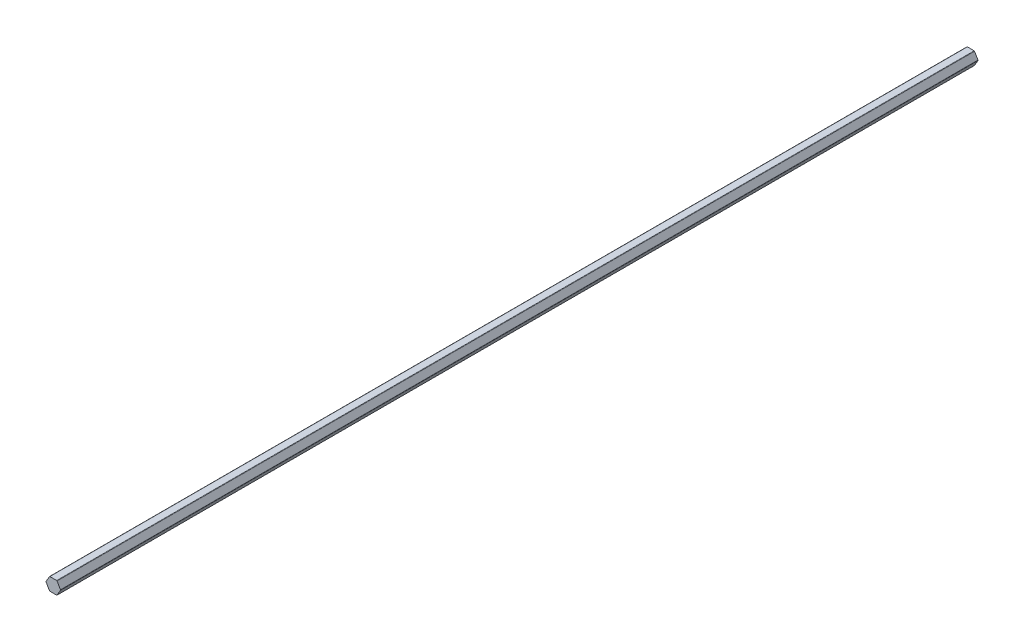
ISO-10303-21;
HEADER;
FILE_DESCRIPTION(('STEP AP214'),'2;1');
FILE_NAME('part.step','',(''),(''),'','','');
FILE_SCHEMA(('AUTOMOTIVE_DESIGN { 1 0 10303 214 1 1 1 1 }'));
ENDSEC;
DATA;
#1=APPLICATION_CONTEXT('core data for automotive mechanical design processes');
#2=APPLICATION_PROTOCOL_DEFINITION('international standard','automotive_design',2000,#1);
#3=PRODUCT_CONTEXT('',#1,'mechanical');
#4=PRODUCT('Part','Part','',(#3));
#5=PRODUCT_RELATED_PRODUCT_CATEGORY('part','',(#4));
#6=PRODUCT_DEFINITION_FORMATION('','',#4);
#7=PRODUCT_DEFINITION_CONTEXT('part definition',#1,'design');
#8=PRODUCT_DEFINITION('design','',#6,#7);
#9=PRODUCT_DEFINITION_SHAPE('','',#8);
#10=(LENGTH_UNIT() NAMED_UNIT(*) SI_UNIT(.MILLI.,.METRE.));
#11=(NAMED_UNIT(*) PLANE_ANGLE_UNIT() SI_UNIT($,.RADIAN.));
#12=(NAMED_UNIT(*) SI_UNIT($,.STERADIAN.) SOLID_ANGLE_UNIT());
#13=UNCERTAINTY_MEASURE_WITH_UNIT(LENGTH_MEASURE(1.E-05),#10,'distance_accuracy_value','');
#14=(GEOMETRIC_REPRESENTATION_CONTEXT(3) GLOBAL_UNCERTAINTY_ASSIGNED_CONTEXT((#13)) GLOBAL_UNIT_ASSIGNED_CONTEXT((#10,
#11,#12)) REPRESENTATION_CONTEXT('',''));
#15=CARTESIAN_POINT('',(0.,0.,0.));
#16=DIRECTION('',(0.,0.,1.));
#17=DIRECTION('',(1.,0.,0.));
#18=AXIS2_PLACEMENT_3D('',#15,#16,#17);
#19=CARTESIAN_POINT('',(3.36554792418709,5.8293,457.2));
#20=DIRECTION('',(0.,0.,-1.));
#21=DIRECTION('',(-1.,0.,0.));
#22=AXIS2_PLACEMENT_3D('',#19,#20,#21);
#23=CYLINDRICAL_SURFACE('',#22,0.508);
#24=CARTESIAN_POINT('',(3.36554792418709,5.8293,457.2));
#25=DIRECTION('',(0.,0.,1.));
#26=DIRECTION('',(1.,0.,0.));
#27=AXIS2_PLACEMENT_3D('',#24,#25,#26);
#28=CIRCLE('',#27,0.508);
#29=CARTESIAN_POINT('',(3.80548882930957,6.0833,457.2));
#30=VERTEX_POINT('',#29);
#31=CARTESIAN_POINT('',(3.36554792418709,6.3373,457.2));
#32=VERTEX_POINT('',#31);
#33=EDGE_CURVE('E262',#30,#32,#28,.T.);
#34=ORIENTED_EDGE('',*,*,#33,.F.);
#35=DIRECTION('',(0.,0.,1.));
#36=VECTOR('',#35,1.);
#37=CARTESIAN_POINT('',(3.80548882930958,6.0833,457.2));
#38=LINE('',#37,#36);
#39=CARTESIAN_POINT('',(3.80548882930957,6.0833,-457.2));
#40=VERTEX_POINT('',#39);
#41=EDGE_CURVE('E289',#40,#30,#38,.T.);
#42=ORIENTED_EDGE('',*,*,#41,.F.);
#43=CARTESIAN_POINT('',(3.36554792418709,5.8293,-457.2));
#44=DIRECTION('',(0.,0.,-1.));
#45=DIRECTION('',(1.,0.,0.));
#46=AXIS2_PLACEMENT_3D('',#43,#44,#45);
#47=CIRCLE('',#46,0.508);
#48=CARTESIAN_POINT('',(3.36554792418709,6.3373,-457.2));
#49=VERTEX_POINT('',#48);
#50=EDGE_CURVE('E203',#49,#40,#47,.T.);
#51=ORIENTED_EDGE('',*,*,#50,.F.);
#52=DIRECTION('',(0.,0.,-1.));
#53=VECTOR('',#52,1.);
#54=CARTESIAN_POINT('',(3.36554792418709,6.3373,457.2));
#55=LINE('',#54,#53);
#56=EDGE_CURVE('E197',#32,#49,#55,.T.);
#57=ORIENTED_EDGE('',*,*,#56,.F.);
#58=EDGE_LOOP('',(#34,#42,#51,#57));
#59=FACE_BOUND('',#58,.T.);
#60=ADVANCED_FACE('F15',(#59),#23,.T.);
#61=CARTESIAN_POINT('',(-3.36554792418709,5.8293,457.2));
#62=DIRECTION('',(0.,0.,-1.));
#63=DIRECTION('',(-1.,0.,0.));
#64=AXIS2_PLACEMENT_3D('',#61,#62,#63);
#65=CYLINDRICAL_SURFACE('',#64,0.508);
#66=CARTESIAN_POINT('',(-3.36554792418709,5.8293,457.2));
#67=DIRECTION('',(0.,0.,1.));
#68=DIRECTION('',(1.,0.,0.));
#69=AXIS2_PLACEMENT_3D('',#66,#67,#68);
#70=CIRCLE('',#69,0.508);
#71=CARTESIAN_POINT('',(-3.36554792418708,6.3373,457.2));
#72=VERTEX_POINT('',#71);
#73=CARTESIAN_POINT('',(-3.80548882930958,6.0833,457.2));
#74=VERTEX_POINT('',#73);
#75=EDGE_CURVE('E271',#72,#74,#70,.T.);
#76=ORIENTED_EDGE('',*,*,#75,.F.);
#77=DIRECTION('',(0.,0.,1.));
#78=VECTOR('',#77,1.);
#79=CARTESIAN_POINT('',(-3.36554792418709,6.3373,457.2));
#80=LINE('',#79,#78);
#81=CARTESIAN_POINT('',(-3.36554792418708,6.3373,-457.2));
#82=VERTEX_POINT('',#81);
#83=EDGE_CURVE('E226',#82,#72,#80,.T.);
#84=ORIENTED_EDGE('',*,*,#83,.F.);
#85=CARTESIAN_POINT('',(-3.36554792418709,5.8293,-457.2));
#86=DIRECTION('',(0.,0.,-1.));
#87=DIRECTION('',(1.,0.,0.));
#88=AXIS2_PLACEMENT_3D('',#85,#86,#87);
#89=CIRCLE('',#88,0.508);
#90=CARTESIAN_POINT('',(-3.80548882930958,6.0833,-457.2));
#91=VERTEX_POINT('',#90);
#92=EDGE_CURVE('E206',#91,#82,#89,.T.);
#93=ORIENTED_EDGE('',*,*,#92,.F.);
#94=DIRECTION('',(0.,0.,-1.));
#95=VECTOR('',#94,1.);
#96=CARTESIAN_POINT('',(-3.80548882930958,6.0833,457.2));
#97=LINE('',#96,#95);
#98=EDGE_CURVE('E274',#74,#91,#97,.T.);
#99=ORIENTED_EDGE('',*,*,#98,.F.);
#100=EDGE_LOOP('',(#76,#84,#93,#99));
#101=FACE_BOUND('',#100,.T.);
#102=ADVANCED_FACE('F336',(#101),#65,.T.);
#103=CARTESIAN_POINT('',(6.73109584837417,0.,457.2));
#104=DIRECTION('',(0.,0.,-1.));
#105=DIRECTION('',(-1.,0.,0.));
#106=AXIS2_PLACEMENT_3D('',#103,#104,#105);
#107=CYLINDRICAL_SURFACE('',#106,0.508);
#108=CARTESIAN_POINT('',(6.73109584837417,0.,457.2));
#109=DIRECTION('',(0.,0.,1.));
#110=DIRECTION('',(1.,0.,0.));
#111=AXIS2_PLACEMENT_3D('',#108,#109,#110);
#112=CIRCLE('',#111,0.508);
#113=CARTESIAN_POINT('',(7.17103675349666,-0.254,457.2));
#114=VERTEX_POINT('',#113);
#115=CARTESIAN_POINT('',(7.17103675349666,0.254000000000004,457.2));
#116=VERTEX_POINT('',#115);
#117=EDGE_CURVE('E208',#114,#116,#112,.T.);
#118=ORIENTED_EDGE('',*,*,#117,.F.);
#119=DIRECTION('',(0.,0.,1.));
#120=VECTOR('',#119,1.);
#121=CARTESIAN_POINT('',(7.17103675349667,-0.253999999999996,457.2));
#122=LINE('',#121,#120);
#123=CARTESIAN_POINT('',(7.17103675349666,-0.254,-457.2));
#124=VERTEX_POINT('',#123);
#125=EDGE_CURVE('E190',#124,#114,#122,.T.);
#126=ORIENTED_EDGE('',*,*,#125,.F.);
#127=CARTESIAN_POINT('',(6.73109584837417,0.,-457.2));
#128=DIRECTION('',(0.,0.,-1.));
#129=DIRECTION('',(1.,0.,0.));
#130=AXIS2_PLACEMENT_3D('',#127,#128,#129);
#131=CIRCLE('',#130,0.508);
#132=CARTESIAN_POINT('',(7.17103675349666,0.254000000000004,-457.2));
#133=VERTEX_POINT('',#132);
#134=EDGE_CURVE('E26',#133,#124,#131,.T.);
#135=ORIENTED_EDGE('',*,*,#134,.F.);
#136=DIRECTION('',(0.,0.,-1.));
#137=VECTOR('',#136,1.);
#138=CARTESIAN_POINT('',(7.17103675349666,0.254,457.2));
#139=LINE('',#138,#137);
#140=EDGE_CURVE('E257',#116,#133,#139,.T.);
#141=ORIENTED_EDGE('',*,*,#140,.F.);
#142=EDGE_LOOP('',(#118,#126,#135,#141));
#143=FACE_BOUND('',#142,.T.);
#144=ADVANCED_FACE('F243',(#143),#107,.T.);
#145=CARTESIAN_POINT('',(3.36554792418709,-5.8293,457.2));
#146=DIRECTION('',(0.,0.,-1.));
#147=DIRECTION('',(-1.,0.,0.));
#148=AXIS2_PLACEMENT_3D('',#145,#146,#147);
#149=CYLINDRICAL_SURFACE('',#148,0.508);
#150=CARTESIAN_POINT('',(3.36554792418709,-5.8293,457.2));
#151=DIRECTION('',(0.,0.,1.));
#152=DIRECTION('',(1.,0.,0.));
#153=AXIS2_PLACEMENT_3D('',#150,#151,#152);
#154=CIRCLE('',#153,0.508);
#155=CARTESIAN_POINT('',(3.36554792418709,-6.3373,457.2));
#156=VERTEX_POINT('',#155);
#157=CARTESIAN_POINT('',(3.80548882930958,-6.0833,457.2));
#158=VERTEX_POINT('',#157);
#159=EDGE_CURVE('E161',#156,#158,#154,.T.);
#160=ORIENTED_EDGE('',*,*,#159,.F.);
#161=DIRECTION('',(0.,0.,1.));
#162=VECTOR('',#161,1.);
#163=CARTESIAN_POINT('',(3.36554792418709,-6.3373,457.2));
#164=LINE('',#163,#162);
#165=CARTESIAN_POINT('',(3.36554792418709,-6.3373,-457.2));
#166=VERTEX_POINT('',#165);
#167=EDGE_CURVE('E162',#166,#156,#164,.T.);
#168=ORIENTED_EDGE('',*,*,#167,.F.);
#169=CARTESIAN_POINT('',(3.36554792418709,-5.8293,-457.2));
#170=DIRECTION('',(0.,0.,-1.));
#171=DIRECTION('',(1.,0.,0.));
#172=AXIS2_PLACEMENT_3D('',#169,#170,#171);
#173=CIRCLE('',#172,0.508);
#174=CARTESIAN_POINT('',(3.80548882930958,-6.0833,-457.2));
#175=VERTEX_POINT('',#174);
#176=EDGE_CURVE('E9',#175,#166,#173,.T.);
#177=ORIENTED_EDGE('',*,*,#176,.F.);
#178=DIRECTION('',(0.,0.,-1.));
#179=VECTOR('',#178,1.);
#180=CARTESIAN_POINT('',(3.80548882930958,-6.0833,457.2));
#181=LINE('',#180,#179);
#182=EDGE_CURVE('E191',#158,#175,#181,.T.);
#183=ORIENTED_EDGE('',*,*,#182,.F.);
#184=EDGE_LOOP('',(#160,#168,#177,#183));
#185=FACE_BOUND('',#184,.T.);
#186=ADVANCED_FACE('F411',(#185),#149,.T.);
#187=CARTESIAN_POINT('',(-6.73109584837417,0.,457.2));
#188=DIRECTION('',(0.,0.,-1.));
#189=DIRECTION('',(-1.,0.,0.));
#190=AXIS2_PLACEMENT_3D('',#187,#188,#189);
#191=CYLINDRICAL_SURFACE('',#190,0.508);
#192=DIRECTION('',(0.,0.,-1.));
#193=VECTOR('',#192,1.);
#194=CARTESIAN_POINT('',(-7.23909584837417,0.,457.2));
#195=LINE('',#194,#193);
#196=CARTESIAN_POINT('',(-7.23909584837417,0.,457.2));
#197=VERTEX_POINT('',#196);
#198=CARTESIAN_POINT('',(-7.23909584837417,0.,-457.2));
#199=VERTEX_POINT('',#198);
#200=EDGE_CURVE('E217',#197,#199,#195,.T.);
#201=ORIENTED_EDGE('',*,*,#200,.F.);
#202=CARTESIAN_POINT('',(-6.73109584837417,0.,457.2));
#203=DIRECTION('',(0.,0.,1.));
#204=DIRECTION('',(1.,0.,0.));
#205=AXIS2_PLACEMENT_3D('',#202,#203,#204);
#206=CIRCLE('',#205,0.508);
#207=CARTESIAN_POINT('',(-7.17103675349666,0.253999999999997,457.2));
#208=VERTEX_POINT('',#207);
#209=EDGE_CURVE('E268',#208,#197,#206,.T.);
#210=ORIENTED_EDGE('',*,*,#209,.F.);
#211=DIRECTION('',(0.,0.,1.));
#212=VECTOR('',#211,1.);
#213=CARTESIAN_POINT('',(-7.17103675349666,0.253999999999995,457.2));
#214=LINE('',#213,#212);
#215=CARTESIAN_POINT('',(-7.17103675349666,0.253999999999997,-457.2));
#216=VERTEX_POINT('',#215);
#217=EDGE_CURVE('E263',#216,#208,#214,.T.);
#218=ORIENTED_EDGE('',*,*,#217,.F.);
#219=CARTESIAN_POINT('',(-6.73109584837417,0.,-457.2));
#220=DIRECTION('',(0.,0.,-1.));
#221=DIRECTION('',(1.,0.,0.));
#222=AXIS2_PLACEMENT_3D('',#219,#220,#221);
#223=CIRCLE('',#222,0.508);
#224=EDGE_CURVE('E117',#199,#216,#223,.T.);
#225=ORIENTED_EDGE('',*,*,#224,.F.);
#226=EDGE_LOOP('',(#201,#210,#218,#225));
#227=FACE_BOUND('',#226,.T.);
#228=ADVANCED_FACE('F341',(#227),#191,.T.);
#229=CARTESIAN_POINT('',(-3.36554792418708,-5.8293,457.2));
#230=DIRECTION('',(0.,0.,-1.));
#231=DIRECTION('',(-1.,0.,0.));
#232=AXIS2_PLACEMENT_3D('',#229,#230,#231);
#233=CYLINDRICAL_SURFACE('',#232,0.508);
#234=CARTESIAN_POINT('',(-3.36554792418708,-5.8293,457.2));
#235=DIRECTION('',(0.,0.,1.));
#236=DIRECTION('',(1.,0.,0.));
#237=AXIS2_PLACEMENT_3D('',#234,#235,#236);
#238=CIRCLE('',#237,0.508);
#239=CARTESIAN_POINT('',(-3.80548882930957,-6.0833,457.2));
#240=VERTEX_POINT('',#239);
#241=CARTESIAN_POINT('',(-3.36554792418708,-6.3373,457.2));
#242=VERTEX_POINT('',#241);
#243=EDGE_CURVE('E151',#240,#242,#238,.T.);
#244=ORIENTED_EDGE('',*,*,#243,.F.);
#245=DIRECTION('',(0.,0.,1.));
#246=VECTOR('',#245,1.);
#247=CARTESIAN_POINT('',(-3.80548882930957,-6.0833,457.2));
#248=LINE('',#247,#246);
#249=CARTESIAN_POINT('',(-3.80548882930957,-6.0833,-457.2));
#250=VERTEX_POINT('',#249);
#251=EDGE_CURVE('E181',#250,#240,#248,.T.);
#252=ORIENTED_EDGE('',*,*,#251,.F.);
#253=CARTESIAN_POINT('',(-3.36554792418708,-5.8293,-457.2));
#254=DIRECTION('',(0.,0.,-1.));
#255=DIRECTION('',(1.,0.,0.));
#256=AXIS2_PLACEMENT_3D('',#253,#254,#255);
#257=CIRCLE('',#256,0.508);
#258=CARTESIAN_POINT('',(-3.36554792418708,-6.3373,-457.2));
#259=VERTEX_POINT('',#258);
#260=EDGE_CURVE('E167',#259,#250,#257,.T.);
#261=ORIENTED_EDGE('',*,*,#260,.F.);
#262=DIRECTION('',(0.,0.,-1.));
#263=VECTOR('',#262,1.);
#264=CARTESIAN_POINT('',(-3.36554792418708,-6.3373,457.2));
#265=LINE('',#264,#263);
#266=EDGE_CURVE('E165',#242,#259,#265,.T.);
#267=ORIENTED_EDGE('',*,*,#266,.F.);
#268=EDGE_LOOP('',(#244,#252,#261,#267));
#269=FACE_BOUND('',#268,.T.);
#270=ADVANCED_FACE('F166',(#269),#233,.T.);
#271=CARTESIAN_POINT('',(7.31768372187083,0.,-457.2));
#272=DIRECTION('',(0.,0.,1.));
#273=DIRECTION('',(1.,0.,0.));
#274=AXIS2_PLACEMENT_3D('',#271,#272,#273);
#275=PLANE('',#274);
#276=DIRECTION('',(1.,0.,0.));
#277=VECTOR('',#276,1.);
#278=CARTESIAN_POINT('',(-3.6588418609354,-6.3373,-457.2));
#279=LINE('',#278,#277);
#280=EDGE_CURVE('E171',#259,#166,#279,.T.);
#281=ORIENTED_EDGE('',*,*,#280,.F.);
#282=ORIENTED_EDGE('',*,*,#260,.T.);
#283=DIRECTION('',(0.5,-0.866025403784439,0.));
#284=VECTOR('',#283,1.);
#285=CARTESIAN_POINT('',(-7.31768372187083,0.,-457.2));
#286=LINE('',#285,#284);
#287=CARTESIAN_POINT('',(-7.17103675349666,-0.254000000000004,-457.2));
#288=VERTEX_POINT('',#287);
#289=EDGE_CURVE('E125',#288,#250,#286,.T.);
#290=ORIENTED_EDGE('',*,*,#289,.F.);
#291=CARTESIAN_POINT('',(-6.73109584837417,0.,-457.2));
#292=DIRECTION('',(0.,0.,-1.));
#293=DIRECTION('',(1.,0.,0.));
#294=AXIS2_PLACEMENT_3D('',#291,#292,#293);
#295=CIRCLE('',#294,0.508);
#296=EDGE_CURVE('E210',#288,#199,#295,.T.);
#297=ORIENTED_EDGE('',*,*,#296,.T.);
#298=ORIENTED_EDGE('',*,*,#224,.T.);
#299=DIRECTION('',(-0.5,-0.866025403784439,0.));
#300=VECTOR('',#299,1.);
#301=CARTESIAN_POINT('',(-3.65884186093541,6.3373,-457.2));
#302=LINE('',#301,#300);
#303=EDGE_CURVE('E201',#91,#216,#302,.T.);
#304=ORIENTED_EDGE('',*,*,#303,.F.);
#305=ORIENTED_EDGE('',*,*,#92,.T.);
#306=DIRECTION('',(-1.,0.,0.));
#307=VECTOR('',#306,1.);
#308=CARTESIAN_POINT('',(3.65884186093541,6.3373,-457.2));
#309=LINE('',#308,#307);
#310=EDGE_CURVE('E229',#49,#82,#309,.T.);
#311=ORIENTED_EDGE('',*,*,#310,.F.);
#312=ORIENTED_EDGE('',*,*,#50,.T.);
#313=DIRECTION('',(-0.5,0.866025403784439,0.));
#314=VECTOR('',#313,1.);
#315=CARTESIAN_POINT('',(7.31768372187083,0.,-457.2));
#316=LINE('',#315,#314);
#317=EDGE_CURVE('E238',#133,#40,#316,.T.);
#318=ORIENTED_EDGE('',*,*,#317,.F.);
#319=ORIENTED_EDGE('',*,*,#134,.T.);
#320=DIRECTION('',(0.5,0.866025403784439,0.));
#321=VECTOR('',#320,1.);
#322=CARTESIAN_POINT('',(3.65884186093541,-6.3373,-457.2));
#323=LINE('',#322,#321);
#324=EDGE_CURVE('E186',#175,#124,#323,.T.);
#325=ORIENTED_EDGE('',*,*,#324,.F.);
#326=ORIENTED_EDGE('',*,*,#176,.T.);
#327=EDGE_LOOP('',(#281,#282,#290,#297,#298,#304,#305,#311,#312,#318,#319,#325,#326));
#328=FACE_BOUND('',#327,.T.);
#329=ADVANCED_FACE('F235',(#328),#275,.F.);
#330=CARTESIAN_POINT('',(7.31768372187083,0.,457.2));
#331=DIRECTION('',(0.,0.,1.));
#332=DIRECTION('',(1.,0.,0.));
#333=AXIS2_PLACEMENT_3D('',#330,#331,#332);
#334=PLANE('',#333);
#335=DIRECTION('',(0.5,-0.866025403784439,0.));
#336=VECTOR('',#335,1.);
#337=CARTESIAN_POINT('',(-7.31768372187083,0.,457.2));
#338=LINE('',#337,#336);
#339=CARTESIAN_POINT('',(-7.17103675349666,-0.254000000000004,457.2));
#340=VERTEX_POINT('',#339);
#341=EDGE_CURVE('E19',#340,#240,#338,.T.);
#342=ORIENTED_EDGE('',*,*,#341,.T.);
#343=ORIENTED_EDGE('',*,*,#243,.T.);
#344=DIRECTION('',(1.,0.,0.));
#345=VECTOR('',#344,1.);
#346=CARTESIAN_POINT('',(-3.6588418609354,-6.3373,457.2));
#347=LINE('',#346,#345);
#348=EDGE_CURVE('E155',#242,#156,#347,.T.);
#349=ORIENTED_EDGE('',*,*,#348,.T.);
#350=ORIENTED_EDGE('',*,*,#159,.T.);
#351=DIRECTION('',(0.5,0.866025403784439,0.));
#352=VECTOR('',#351,1.);
#353=CARTESIAN_POINT('',(3.65884186093541,-6.3373,457.2));
#354=LINE('',#353,#352);
#355=EDGE_CURVE('E192',#158,#114,#354,.T.);
#356=ORIENTED_EDGE('',*,*,#355,.T.);
#357=ORIENTED_EDGE('',*,*,#117,.T.);
#358=DIRECTION('',(-0.5,0.866025403784439,0.));
#359=VECTOR('',#358,1.);
#360=CARTESIAN_POINT('',(7.31768372187083,0.,457.2));
#361=LINE('',#360,#359);
#362=EDGE_CURVE('E247',#116,#30,#361,.T.);
#363=ORIENTED_EDGE('',*,*,#362,.T.);
#364=ORIENTED_EDGE('',*,*,#33,.T.);
#365=DIRECTION('',(-1.,0.,0.));
#366=VECTOR('',#365,1.);
#367=CARTESIAN_POINT('',(3.65884186093541,6.3373,457.2));
#368=LINE('',#367,#366);
#369=EDGE_CURVE('E202',#32,#72,#368,.T.);
#370=ORIENTED_EDGE('',*,*,#369,.T.);
#371=ORIENTED_EDGE('',*,*,#75,.T.);
#372=DIRECTION('',(-0.5,-0.866025403784439,0.));
#373=VECTOR('',#372,1.);
#374=CARTESIAN_POINT('',(-3.65884186093541,6.3373,457.2));
#375=LINE('',#374,#373);
#376=EDGE_CURVE('E267',#74,#208,#375,.T.);
#377=ORIENTED_EDGE('',*,*,#376,.T.);
#378=ORIENTED_EDGE('',*,*,#209,.T.);
#379=CARTESIAN_POINT('',(-6.73109584837417,0.,457.2));
#380=DIRECTION('',(0.,0.,1.));
#381=DIRECTION('',(1.,0.,0.));
#382=AXIS2_PLACEMENT_3D('',#379,#380,#381);
#383=CIRCLE('',#382,0.508);
#384=EDGE_CURVE('E184',#197,#340,#383,.T.);
#385=ORIENTED_EDGE('',*,*,#384,.T.);
#386=EDGE_LOOP('',(#342,#343,#349,#350,#356,#357,#363,#364,#370,#371,#377,#378,#385));
#387=FACE_BOUND('',#386,.T.);
#388=ADVANCED_FACE('F153',(#387),#334,.T.);
#389=CARTESIAN_POINT('',(-3.6588418609354,-6.3373,457.2));
#390=DIRECTION('',(0.,1.,0.));
#391=DIRECTION('',(1.,0.,0.));
#392=AXIS2_PLACEMENT_3D('',#389,#390,#391);
#393=PLANE('',#392);
#394=ORIENTED_EDGE('',*,*,#348,.F.);
#395=ORIENTED_EDGE('',*,*,#266,.T.);
#396=ORIENTED_EDGE('',*,*,#280,.T.);
#397=ORIENTED_EDGE('',*,*,#167,.T.);
#398=EDGE_LOOP('',(#394,#395,#396,#397));
#399=FACE_BOUND('',#398,.T.);
#400=ADVANCED_FACE('F174',(#399),#393,.F.);
#401=CARTESIAN_POINT('',(-7.31768372187083,0.,457.2));
#402=DIRECTION('',(0.866025403784438,0.5,0.));
#403=DIRECTION('',(0.,0.,-1.));
#404=AXIS2_PLACEMENT_3D('',#401,#402,#403);
#405=PLANE('',#404);
#406=ORIENTED_EDGE('',*,*,#289,.T.);
#407=ORIENTED_EDGE('',*,*,#251,.T.);
#408=ORIENTED_EDGE('',*,*,#341,.F.);
#409=DIRECTION('',(0.,0.,-1.));
#410=VECTOR('',#409,1.);
#411=CARTESIAN_POINT('',(-7.17103675349666,-0.254000000000004,457.2));
#412=LINE('',#411,#410);
#413=EDGE_CURVE('E196',#340,#288,#412,.T.);
#414=ORIENTED_EDGE('',*,*,#413,.T.);
#415=EDGE_LOOP('',(#406,#407,#408,#414));
#416=FACE_BOUND('',#415,.T.);
#417=ADVANCED_FACE('F17',(#416),#405,.F.);
#418=CARTESIAN_POINT('',(-3.65884186093541,6.3373,457.2));
#419=DIRECTION('',(0.866025403784439,-0.5,0.));
#420=DIRECTION('',(0.,0.,-1.));
#421=AXIS2_PLACEMENT_3D('',#418,#419,#420);
#422=PLANE('',#421);
#423=ORIENTED_EDGE('',*,*,#303,.T.);
#424=ORIENTED_EDGE('',*,*,#217,.T.);
#425=ORIENTED_EDGE('',*,*,#376,.F.);
#426=ORIENTED_EDGE('',*,*,#98,.T.);
#427=EDGE_LOOP('',(#423,#424,#425,#426));
#428=FACE_BOUND('',#427,.T.);
#429=ADVANCED_FACE('F339',(#428),#422,.F.);
#430=CARTESIAN_POINT('',(3.65884186093541,6.3373,457.2));
#431=DIRECTION('',(0.,-1.,0.));
#432=DIRECTION('',(0.,0.,-1.));
#433=AXIS2_PLACEMENT_3D('',#430,#431,#432);
#434=PLANE('',#433);
#435=ORIENTED_EDGE('',*,*,#310,.T.);
#436=ORIENTED_EDGE('',*,*,#83,.T.);
#437=ORIENTED_EDGE('',*,*,#369,.F.);
#438=ORIENTED_EDGE('',*,*,#56,.T.);
#439=EDGE_LOOP('',(#435,#436,#437,#438));
#440=FACE_BOUND('',#439,.T.);
#441=ADVANCED_FACE('F334',(#440),#434,.F.);
#442=CARTESIAN_POINT('',(7.31768372187083,0.,457.2));
#443=DIRECTION('',(-0.866025403784439,-0.5,0.));
#444=DIRECTION('',(-0.5,0.866025403784439,0.));
#445=AXIS2_PLACEMENT_3D('',#442,#443,#444);
#446=PLANE('',#445);
#447=ORIENTED_EDGE('',*,*,#362,.F.);
#448=ORIENTED_EDGE('',*,*,#140,.T.);
#449=ORIENTED_EDGE('',*,*,#317,.T.);
#450=ORIENTED_EDGE('',*,*,#41,.T.);
#451=EDGE_LOOP('',(#447,#448,#449,#450));
#452=FACE_BOUND('',#451,.T.);
#453=ADVANCED_FACE('F327',(#452),#446,.F.);
#454=CARTESIAN_POINT('',(3.65884186093541,-6.3373,457.2));
#455=DIRECTION('',(-0.866025403784439,0.5,0.));
#456=DIRECTION('',(0.,0.,1.));
#457=AXIS2_PLACEMENT_3D('',#454,#455,#456);
#458=PLANE('',#457);
#459=ORIENTED_EDGE('',*,*,#355,.F.);
#460=ORIENTED_EDGE('',*,*,#182,.T.);
#461=ORIENTED_EDGE('',*,*,#324,.T.);
#462=ORIENTED_EDGE('',*,*,#125,.T.);
#463=EDGE_LOOP('',(#459,#460,#461,#462));
#464=FACE_BOUND('',#463,.T.);
#465=ADVANCED_FACE('F249',(#464),#458,.F.);
#466=CARTESIAN_POINT('',(-6.73109584837417,0.,457.2));
#467=DIRECTION('',(0.,0.,-1.));
#468=DIRECTION('',(-1.,0.,0.));
#469=AXIS2_PLACEMENT_3D('',#466,#467,#468);
#470=CYLINDRICAL_SURFACE('',#469,0.508);
#471=ORIENTED_EDGE('',*,*,#384,.F.);
#472=ORIENTED_EDGE('',*,*,#200,.T.);
#473=ORIENTED_EDGE('',*,*,#296,.F.);
#474=ORIENTED_EDGE('',*,*,#413,.F.);
#475=EDGE_LOOP('',(#471,#472,#473,#474));
#476=FACE_BOUND('',#475,.T.);
#477=ADVANCED_FACE('F343',(#476),#470,.T.);
#478=CLOSED_SHELL('',(#60,#102,#144,#186,#228,#270,#329,#388,#400,#417,#429,#441,#453,#465,#477));
#479=MANIFOLD_SOLID_BREP('B1',#478);
#480=ADVANCED_BREP_SHAPE_REPRESENTATION('',(#18,#479),#14);
#481=SHAPE_DEFINITION_REPRESENTATION(#9,#480);
ENDSEC;
END-ISO-10303-21;
